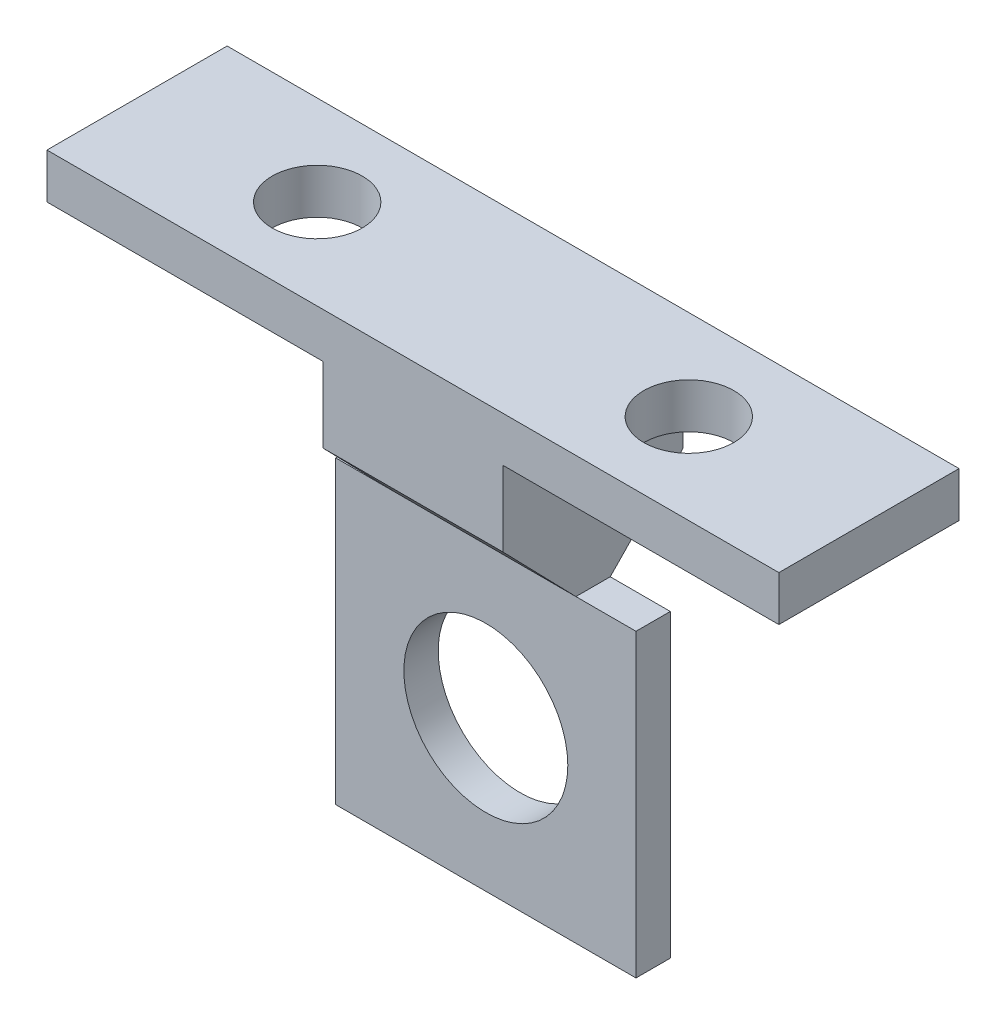
ISO-10303-21;
HEADER;
FILE_DESCRIPTION(('STEP AP214'),'2;1');
FILE_NAME('part.step','',(''),(''),'','','');
FILE_SCHEMA(('AUTOMOTIVE_DESIGN { 1 0 10303 214 1 1 1 1 }'));
ENDSEC;
DATA;
#1=APPLICATION_CONTEXT('core data for automotive mechanical design processes');
#2=APPLICATION_PROTOCOL_DEFINITION('international standard','automotive_design',2000,#1);
#3=PRODUCT_CONTEXT('',#1,'mechanical');
#4=PRODUCT('Part','Part','',(#3));
#5=PRODUCT_RELATED_PRODUCT_CATEGORY('part','',(#4));
#6=PRODUCT_DEFINITION_FORMATION('','',#4);
#7=PRODUCT_DEFINITION_CONTEXT('part definition',#1,'design');
#8=PRODUCT_DEFINITION('design','',#6,#7);
#9=PRODUCT_DEFINITION_SHAPE('','',#8);
#10=(LENGTH_UNIT() NAMED_UNIT(*) SI_UNIT(.MILLI.,.METRE.));
#11=(NAMED_UNIT(*) PLANE_ANGLE_UNIT() SI_UNIT($,.RADIAN.));
#12=(NAMED_UNIT(*) SI_UNIT($,.STERADIAN.) SOLID_ANGLE_UNIT());
#13=UNCERTAINTY_MEASURE_WITH_UNIT(LENGTH_MEASURE(1.E-05),#10,'distance_accuracy_value','');
#14=(GEOMETRIC_REPRESENTATION_CONTEXT(3) GLOBAL_UNCERTAINTY_ASSIGNED_CONTEXT((#13)) GLOBAL_UNIT_ASSIGNED_CONTEXT((#10,
#11,#12)) REPRESENTATION_CONTEXT('',''));
#15=CARTESIAN_POINT('',(0.,0.,0.));
#16=DIRECTION('',(0.,0.,1.));
#17=DIRECTION('',(1.,0.,0.));
#18=AXIS2_PLACEMENT_3D('',#15,#16,#17);
#19=CARTESIAN_POINT('',(-33.0408964823714,13.4768329024308,2.286));
#20=DIRECTION('',(0.,1.,0.));
#21=DIRECTION('',(0.,0.,1.));
#22=AXIS2_PLACEMENT_3D('',#19,#20,#21);
#23=PLANE('',#22);
#24=CARTESIAN_POINT('',(-26.6665293523715,13.4768329024308,1.143));
#25=DIRECTION('',(0.,1.,0.));
#26=DIRECTION('',(0.,0.,1.));
#27=AXIS2_PLACEMENT_3D('',#24,#25,#26);
#28=CIRCLE('',#27,2.99999999999999);
#29=CARTESIAN_POINT('',(-26.6665293523715,13.4768329024308,4.14299999999999));
#30=VERTEX_POINT('',#29);
#31=EDGE_CURVE('E302',#30,#30,#28,.F.);
#32=ORIENTED_EDGE('',*,*,#31,.F.);
#33=EDGE_LOOP('',(#32));
#34=FACE_BOUND('',#33,.T.);
#35=DIRECTION('',(0.,0.,-1.));
#36=VECTOR('',#35,1.);
#37=CARTESIAN_POINT('',(-33.0408964823714,13.4768329024308,2.286));
#38=LINE('',#37,#36);
#39=CARTESIAN_POINT('',(-33.0408964823714,13.4768329024311,7.143));
#40=VERTEX_POINT('',#39);
#41=CARTESIAN_POINT('',(-33.0408964823714,13.4768329024311,-4.857));
#42=VERTEX_POINT('',#41);
#43=EDGE_CURVE('E60',#40,#42,#38,.T.);
#44=ORIENTED_EDGE('',*,*,#43,.T.);
#45=DIRECTION('',(-1.,0.,0.));
#46=VECTOR('',#45,1.);
#47=CARTESIAN_POINT('',(-2.29721093551843,13.4768329024311,-4.857));
#48=LINE('',#47,#46);
#49=CARTESIAN_POINT('',(-14.6665278123714,13.4768329024311,-4.857));
#50=VERTEX_POINT('',#49);
#51=EDGE_CURVE('E202',#50,#42,#48,.T.);
#52=ORIENTED_EDGE('',*,*,#51,.F.);
#53=DIRECTION('',(0.,0.,-1.));
#54=VECTOR('',#53,1.);
#55=CARTESIAN_POINT('',(-14.6665278123714,13.4768329024308,2.286));
#56=LINE('',#55,#54);
#57=CARTESIAN_POINT('',(-14.6665278123714,13.4768329024311,7.143));
#58=VERTEX_POINT('',#57);
#59=EDGE_CURVE('E229',#58,#50,#56,.T.);
#60=ORIENTED_EDGE('',*,*,#59,.F.);
#61=DIRECTION('',(-1.,0.,0.));
#62=VECTOR('',#61,1.);
#63=CARTESIAN_POINT('',(-2.29721093551843,13.4768329024311,7.143));
#64=LINE('',#63,#62);
#65=EDGE_CURVE('E199',#58,#40,#64,.T.);
#66=ORIENTED_EDGE('',*,*,#65,.T.);
#67=EDGE_LOOP('',(#44,#52,#60,#66));
#68=FACE_BOUND('',#67,.T.);
#69=ADVANCED_FACE('F37',(#34,#68),#23,.F.);
#70=CARTESIAN_POINT('',(-51.4152636123715,13.4768329024308,1.143));
#71=DIRECTION('',(0.,1.,0.));
#72=DIRECTION('',(0.,0.,1.));
#73=AXIS2_PLACEMENT_3D('',#70,#71,#72);
#74=CIRCLE('',#73,3.);
#75=CARTESIAN_POINT('',(-51.4152636123715,13.4768329024308,4.143));
#76=VERTEX_POINT('',#75);
#77=EDGE_CURVE('E307',#76,#76,#74,.F.);
#78=ORIENTED_EDGE('',*,*,#77,.F.);
#79=EDGE_LOOP('',(#78));
#80=FACE_BOUND('',#79,.T.);
#81=DIRECTION('',(0.,0.,-1.));
#82=VECTOR('',#81,1.);
#83=CARTESIAN_POINT('',(-45.0408964823714,13.4768329024308,2.286));
#84=LINE('',#83,#82);
#85=CARTESIAN_POINT('',(-45.0408964823714,13.4768329024311,7.143));
#86=VERTEX_POINT('',#85);
#87=CARTESIAN_POINT('',(-45.0408964823714,13.4768329024311,-4.857));
#88=VERTEX_POINT('',#87);
#89=EDGE_CURVE('E46',#86,#88,#84,.T.);
#90=ORIENTED_EDGE('',*,*,#89,.F.);
#91=CARTESIAN_POINT('',(-63.4152651523715,13.4768329024311,7.143));
#92=VERTEX_POINT('',#91);
#93=EDGE_CURVE('E201',#86,#92,#64,.T.);
#94=ORIENTED_EDGE('',*,*,#93,.T.);
#95=DIRECTION('',(0.,0.,-1.));
#96=VECTOR('',#95,1.);
#97=CARTESIAN_POINT('',(-63.4152651523715,13.4768329024308,2.286));
#98=LINE('',#97,#96);
#99=CARTESIAN_POINT('',(-63.4152651523715,13.4768329024311,-4.857));
#100=VERTEX_POINT('',#99);
#101=EDGE_CURVE('E11',#92,#100,#98,.T.);
#102=ORIENTED_EDGE('',*,*,#101,.T.);
#103=EDGE_CURVE('E193',#88,#100,#48,.T.);
#104=ORIENTED_EDGE('',*,*,#103,.F.);
#105=EDGE_LOOP('',(#90,#94,#102,#104));
#106=FACE_BOUND('',#105,.T.);
#107=ADVANCED_FACE('F338',(#80,#106),#23,.F.);
#108=CARTESIAN_POINT('',(-63.4152651523714,16.4768329024308,2.286));
#109=DIRECTION('',(1.,0.,0.));
#110=DIRECTION('',(0.,1.,0.));
#111=AXIS2_PLACEMENT_3D('',#108,#109,#110);
#112=PLANE('',#111);
#113=DIRECTION('',(0.,0.,-1.));
#114=VECTOR('',#113,1.);
#115=CARTESIAN_POINT('',(-63.4152651523714,16.4768329024308,2.286));
#116=LINE('',#115,#114);
#117=CARTESIAN_POINT('',(-63.4152651523715,16.4768329024311,7.143));
#118=VERTEX_POINT('',#117);
#119=CARTESIAN_POINT('',(-63.4152651523715,16.4768329024311,-4.857));
#120=VERTEX_POINT('',#119);
#121=EDGE_CURVE('E216',#118,#120,#116,.T.);
#122=ORIENTED_EDGE('',*,*,#121,.T.);
#123=DIRECTION('',(0.,-1.,0.));
#124=VECTOR('',#123,1.);
#125=CARTESIAN_POINT('',(-63.4152651523715,16.4768329024311,-4.857));
#126=LINE('',#125,#124);
#127=EDGE_CURVE('E179',#120,#100,#126,.T.);
#128=ORIENTED_EDGE('',*,*,#127,.T.);
#129=ORIENTED_EDGE('',*,*,#101,.F.);
#130=DIRECTION('',(0.,1.,0.));
#131=VECTOR('',#130,1.);
#132=CARTESIAN_POINT('',(-63.4152651523715,16.4768329024311,7.143));
#133=LINE('',#132,#131);
#134=EDGE_CURVE('E190',#92,#118,#133,.T.);
#135=ORIENTED_EDGE('',*,*,#134,.T.);
#136=EDGE_LOOP('',(#122,#128,#129,#135));
#137=FACE_BOUND('',#136,.T.);
#138=ADVANCED_FACE('F39',(#137),#112,.F.);
#139=CARTESIAN_POINT('',(-45.0408964823714,8.47683290243078,2.286));
#140=DIRECTION('',(1.,0.,0.));
#141=DIRECTION('',(0.,0.,-1.));
#142=AXIS2_PLACEMENT_3D('',#139,#140,#141);
#143=PLANE('',#142);
#144=ORIENTED_EDGE('',*,*,#89,.T.);
#145=DIRECTION('',(0.,-1.,0.));
#146=VECTOR('',#145,1.);
#147=CARTESIAN_POINT('',(-45.0408964823714,13.4768329024311,-4.857));
#148=LINE('',#147,#146);
#149=CARTESIAN_POINT('',(-45.0408964823714,8.47683290243107,-4.857));
#150=VERTEX_POINT('',#149);
#151=EDGE_CURVE('E165',#88,#150,#148,.T.);
#152=ORIENTED_EDGE('',*,*,#151,.T.);
#153=DIRECTION('',(0.,-0.71728962347272,0.696775140241358));
#154=VECTOR('',#153,1.);
#155=CARTESIAN_POINT('',(-45.0408964823714,8.47683290243107,-4.857));
#156=LINE('',#155,#154);
#157=CARTESIAN_POINT('',(-45.0408964823714,3.47683290243076,0.));
#158=VERTEX_POINT('',#157);
#159=EDGE_CURVE('E297',#150,#158,#156,.T.);
#160=ORIENTED_EDGE('',*,*,#159,.T.);
#161=DIRECTION('',(0.,0.,-1.));
#162=VECTOR('',#161,1.);
#163=CARTESIAN_POINT('',(-45.0408964823714,3.47683290243078,2.286));
#164=LINE('',#163,#162);
#165=CARTESIAN_POINT('',(-45.0408964823714,3.47683290243078,2.286));
#166=VERTEX_POINT('',#165);
#167=EDGE_CURVE('E246',#166,#158,#164,.T.);
#168=ORIENTED_EDGE('',*,*,#167,.F.);
#169=DIRECTION('',(0.,0.71728962347272,0.696775140241358));
#170=VECTOR('',#169,1.);
#171=CARTESIAN_POINT('',(-45.0408964823714,3.47683290243076,2.286));
#172=LINE('',#171,#170);
#173=CARTESIAN_POINT('',(-45.0408964823714,8.47683290243107,7.143));
#174=VERTEX_POINT('',#173);
#175=EDGE_CURVE('E173',#166,#174,#172,.T.);
#176=ORIENTED_EDGE('',*,*,#175,.T.);
#177=DIRECTION('',(0.,1.,0.));
#178=VECTOR('',#177,1.);
#179=CARTESIAN_POINT('',(-45.0408964823714,8.47683290243107,7.143));
#180=LINE('',#179,#178);
#181=EDGE_CURVE('E147',#174,#86,#180,.T.);
#182=ORIENTED_EDGE('',*,*,#181,.T.);
#183=EDGE_LOOP('',(#144,#152,#160,#168,#176,#182));
#184=FACE_BOUND('',#183,.T.);
#185=ADVANCED_FACE('F296',(#184),#143,.F.);
#186=CARTESIAN_POINT('',(-45.0408964823714,3.47683290243078,2.286));
#187=DIRECTION('',(0.,-1.,0.));
#188=DIRECTION('',(1.,0.,0.));
#189=AXIS2_PLACEMENT_3D('',#186,#187,#188);
#190=PLANE('',#189);
#191=DIRECTION('',(-1.,0.,0.));
#192=VECTOR('',#191,1.);
#193=CARTESIAN_POINT('',(-45.0408964823714,3.47683290243078,0.));
#194=LINE('',#193,#192);
#195=CARTESIAN_POINT('',(-49.0408964823714,3.47683290243077,0.));
#196=VERTEX_POINT('',#195);
#197=EDGE_CURVE('E187',#158,#196,#194,.T.);
#198=ORIENTED_EDGE('',*,*,#197,.T.);
#199=DIRECTION('',(0.,0.,-1.));
#200=VECTOR('',#199,1.);
#201=CARTESIAN_POINT('',(-49.0408964823714,3.47683290243077,2.286));
#202=LINE('',#201,#200);
#203=CARTESIAN_POINT('',(-49.0408964823714,3.47683290243077,2.286));
#204=VERTEX_POINT('',#203);
#205=EDGE_CURVE('E243',#204,#196,#202,.T.);
#206=ORIENTED_EDGE('',*,*,#205,.F.);
#207=DIRECTION('',(-1.,0.,0.));
#208=VECTOR('',#207,1.);
#209=CARTESIAN_POINT('',(-45.0408964823714,3.47683290243078,2.286));
#210=LINE('',#209,#208);
#211=EDGE_CURVE('E205',#166,#204,#210,.T.);
#212=ORIENTED_EDGE('',*,*,#211,.F.);
#213=ORIENTED_EDGE('',*,*,#167,.T.);
#214=EDGE_LOOP('',(#198,#206,#212,#213));
#215=FACE_BOUND('',#214,.T.);
#216=ADVANCED_FACE('F253',(#215),#190,.F.);
#217=CARTESIAN_POINT('',(-49.0408964823714,3.47683290243077,2.286));
#218=DIRECTION('',(1.,0.,0.));
#219=DIRECTION('',(0.,1.,0.));
#220=AXIS2_PLACEMENT_3D('',#217,#218,#219);
#221=PLANE('',#220);
#222=DIRECTION('',(0.,-1.,0.));
#223=VECTOR('',#222,1.);
#224=CARTESIAN_POINT('',(-49.0408964823714,3.47683290243077,0.));
#225=LINE('',#224,#223);
#226=CARTESIAN_POINT('',(-49.0408964823714,-16.5231670975692,0.));
#227=VERTEX_POINT('',#226);
#228=EDGE_CURVE('E218',#196,#227,#225,.T.);
#229=ORIENTED_EDGE('',*,*,#228,.T.);
#230=DIRECTION('',(0.,0.,-1.));
#231=VECTOR('',#230,1.);
#232=CARTESIAN_POINT('',(-49.0408964823714,-16.5231670975692,2.286));
#233=LINE('',#232,#231);
#234=CARTESIAN_POINT('',(-49.0408964823714,-16.5231670975692,2.286));
#235=VERTEX_POINT('',#234);
#236=EDGE_CURVE('E240',#235,#227,#233,.T.);
#237=ORIENTED_EDGE('',*,*,#236,.F.);
#238=DIRECTION('',(0.,-1.,0.));
#239=VECTOR('',#238,1.);
#240=CARTESIAN_POINT('',(-49.0408964823714,3.47683290243077,2.286));
#241=LINE('',#240,#239);
#242=EDGE_CURVE('E207',#204,#235,#241,.T.);
#243=ORIENTED_EDGE('',*,*,#242,.F.);
#244=ORIENTED_EDGE('',*,*,#205,.T.);
#245=EDGE_LOOP('',(#229,#237,#243,#244));
#246=FACE_BOUND('',#245,.T.);
#247=ADVANCED_FACE('F264',(#246),#221,.F.);
#248=CARTESIAN_POINT('',(-49.0408964823714,-16.5231670975692,2.286));
#249=DIRECTION('',(0.,1.,0.));
#250=DIRECTION('',(-1.,0.,0.));
#251=AXIS2_PLACEMENT_3D('',#248,#249,#250);
#252=PLANE('',#251);
#253=DIRECTION('',(1.,0.,0.));
#254=VECTOR('',#253,1.);
#255=CARTESIAN_POINT('',(-49.0408964823714,-16.5231670975692,0.));
#256=LINE('',#255,#254);
#257=CARTESIAN_POINT('',(-29.0408964823714,-16.5231670975692,0.));
#258=VERTEX_POINT('',#257);
#259=EDGE_CURVE('E220',#227,#258,#256,.T.);
#260=ORIENTED_EDGE('',*,*,#259,.T.);
#261=DIRECTION('',(0.,0.,-1.));
#262=VECTOR('',#261,1.);
#263=CARTESIAN_POINT('',(-29.0408964823714,-16.5231670975692,2.286));
#264=LINE('',#263,#262);
#265=CARTESIAN_POINT('',(-29.0408964823714,-16.5231670975692,2.286));
#266=VERTEX_POINT('',#265);
#267=EDGE_CURVE('E237',#266,#258,#264,.T.);
#268=ORIENTED_EDGE('',*,*,#267,.F.);
#269=DIRECTION('',(1.,0.,0.));
#270=VECTOR('',#269,1.);
#271=CARTESIAN_POINT('',(-49.0408964823714,-16.5231670975692,2.286));
#272=LINE('',#271,#270);
#273=EDGE_CURVE('E210',#235,#266,#272,.T.);
#274=ORIENTED_EDGE('',*,*,#273,.F.);
#275=ORIENTED_EDGE('',*,*,#236,.T.);
#276=EDGE_LOOP('',(#260,#268,#274,#275));
#277=FACE_BOUND('',#276,.T.);
#278=ADVANCED_FACE('F268',(#277),#252,.F.);
#279=CARTESIAN_POINT('',(-29.0408964823714,3.47683290243078,2.286));
#280=DIRECTION('',(-1.,0.,0.));
#281=DIRECTION('',(0.,0.,1.));
#282=AXIS2_PLACEMENT_3D('',#279,#280,#281);
#283=PLANE('',#282);
#284=DIRECTION('',(0.,1.,0.));
#285=VECTOR('',#284,1.);
#286=CARTESIAN_POINT('',(-29.0408964823714,3.47683290243078,0.));
#287=LINE('',#286,#285);
#288=CARTESIAN_POINT('',(-29.0408964823714,3.47683290243078,0.));
#289=VERTEX_POINT('',#288);
#290=EDGE_CURVE('E222',#258,#289,#287,.T.);
#291=ORIENTED_EDGE('',*,*,#290,.T.);
#292=DIRECTION('',(0.,0.,-1.));
#293=VECTOR('',#292,1.);
#294=CARTESIAN_POINT('',(-29.0408964823714,3.47683290243078,2.286));
#295=LINE('',#294,#293);
#296=CARTESIAN_POINT('',(-29.0408964823714,3.47683290243078,2.286));
#297=VERTEX_POINT('',#296);
#298=EDGE_CURVE('E234',#297,#289,#295,.T.);
#299=ORIENTED_EDGE('',*,*,#298,.F.);
#300=DIRECTION('',(0.,1.,0.));
#301=VECTOR('',#300,1.);
#302=CARTESIAN_POINT('',(-29.0408964823714,3.47683290243078,2.286));
#303=LINE('',#302,#301);
#304=EDGE_CURVE('E212',#266,#297,#303,.T.);
#305=ORIENTED_EDGE('',*,*,#304,.F.);
#306=ORIENTED_EDGE('',*,*,#267,.T.);
#307=EDGE_LOOP('',(#291,#299,#305,#306));
#308=FACE_BOUND('',#307,.T.);
#309=ADVANCED_FACE('F352',(#308),#283,.F.);
#310=CARTESIAN_POINT('',(-29.0408964823714,3.47683290243078,2.286));
#311=DIRECTION('',(0.,-1.,0.));
#312=DIRECTION('',(1.,0.,0.));
#313=AXIS2_PLACEMENT_3D('',#310,#311,#312);
#314=PLANE('',#313);
#315=DIRECTION('',(-1.,0.,0.));
#316=VECTOR('',#315,1.);
#317=CARTESIAN_POINT('',(-29.0408964823714,3.47683290243078,0.));
#318=LINE('',#317,#316);
#319=CARTESIAN_POINT('',(-33.0408964823714,3.47683290243076,0.));
#320=VERTEX_POINT('',#319);
#321=EDGE_CURVE('E208',#289,#320,#318,.T.);
#322=ORIENTED_EDGE('',*,*,#321,.T.);
#323=DIRECTION('',(0.,0.,-1.));
#324=VECTOR('',#323,1.);
#325=CARTESIAN_POINT('',(-33.0408964823714,3.47683290243078,2.286));
#326=LINE('',#325,#324);
#327=CARTESIAN_POINT('',(-33.0408964823714,3.47683290243078,2.286));
#328=VERTEX_POINT('',#327);
#329=EDGE_CURVE('E232',#328,#320,#326,.T.);
#330=ORIENTED_EDGE('',*,*,#329,.F.);
#331=DIRECTION('',(-1.,0.,0.));
#332=VECTOR('',#331,1.);
#333=CARTESIAN_POINT('',(-29.0408964823714,3.47683290243078,2.286));
#334=LINE('',#333,#332);
#335=EDGE_CURVE('E214',#297,#328,#334,.T.);
#336=ORIENTED_EDGE('',*,*,#335,.F.);
#337=ORIENTED_EDGE('',*,*,#298,.T.);
#338=EDGE_LOOP('',(#322,#330,#336,#337));
#339=FACE_BOUND('',#338,.T.);
#340=ADVANCED_FACE('F277',(#339),#314,.F.);
#341=CARTESIAN_POINT('',(-33.0408964823714,13.4768329024308,2.286));
#342=DIRECTION('',(-1.,0.,0.));
#343=DIRECTION('',(0.,0.,1.));
#344=AXIS2_PLACEMENT_3D('',#341,#342,#343);
#345=PLANE('',#344);
#346=ORIENTED_EDGE('',*,*,#329,.T.);
#347=DIRECTION('',(0.,0.71728962347272,-0.696775140241358));
#348=VECTOR('',#347,1.);
#349=CARTESIAN_POINT('',(-33.0408964823714,8.47683290243107,-4.857));
#350=LINE('',#349,#348);
#351=CARTESIAN_POINT('',(-33.0408964823714,8.47683290243107,-4.857));
#352=VERTEX_POINT('',#351);
#353=EDGE_CURVE('E158',#320,#352,#350,.T.);
#354=ORIENTED_EDGE('',*,*,#353,.T.);
#355=DIRECTION('',(0.,1.,0.));
#356=VECTOR('',#355,1.);
#357=CARTESIAN_POINT('',(-33.0408964823714,13.4768329024311,-4.857));
#358=LINE('',#357,#356);
#359=EDGE_CURVE('E151',#352,#42,#358,.T.);
#360=ORIENTED_EDGE('',*,*,#359,.T.);
#361=ORIENTED_EDGE('',*,*,#43,.F.);
#362=DIRECTION('',(0.,-1.,0.));
#363=VECTOR('',#362,1.);
#364=CARTESIAN_POINT('',(-33.0408964823714,8.47683290243107,7.143));
#365=LINE('',#364,#363);
#366=CARTESIAN_POINT('',(-33.0408964823714,8.47683290243107,7.143));
#367=VERTEX_POINT('',#366);
#368=EDGE_CURVE('E145',#40,#367,#365,.T.);
#369=ORIENTED_EDGE('',*,*,#368,.T.);
#370=DIRECTION('',(0.,-0.71728962347272,-0.696775140241358));
#371=VECTOR('',#370,1.);
#372=CARTESIAN_POINT('',(-33.0408964823714,3.47683290243076,2.286));
#373=LINE('',#372,#371);
#374=EDGE_CURVE('E155',#367,#328,#373,.T.);
#375=ORIENTED_EDGE('',*,*,#374,.T.);
#376=EDGE_LOOP('',(#346,#354,#360,#361,#369,#375));
#377=FACE_BOUND('',#376,.T.);
#378=ADVANCED_FACE('F160',(#377),#345,.F.);
#379=CARTESIAN_POINT('',(-14.6665278123714,16.4768329024308,2.286));
#380=DIRECTION('',(-1.,0.,0.));
#381=DIRECTION('',(0.,-1.,0.));
#382=AXIS2_PLACEMENT_3D('',#379,#380,#381);
#383=PLANE('',#382);
#384=ORIENTED_EDGE('',*,*,#59,.T.);
#385=DIRECTION('',(0.,1.,0.));
#386=VECTOR('',#385,1.);
#387=CARTESIAN_POINT('',(-14.6665278123714,16.476832902431,-4.857));
#388=LINE('',#387,#386);
#389=CARTESIAN_POINT('',(-14.6665278123714,16.4768329024311,-4.857));
#390=VERTEX_POINT('',#389);
#391=EDGE_CURVE('E183',#50,#390,#388,.T.);
#392=ORIENTED_EDGE('',*,*,#391,.T.);
#393=DIRECTION('',(0.,0.,-1.));
#394=VECTOR('',#393,1.);
#395=CARTESIAN_POINT('',(-14.6665278123714,16.4768329024308,2.286));
#396=LINE('',#395,#394);
#397=CARTESIAN_POINT('',(-14.6665278123714,16.4768329024311,7.143));
#398=VERTEX_POINT('',#397);
#399=EDGE_CURVE('E227',#398,#390,#396,.T.);
#400=ORIENTED_EDGE('',*,*,#399,.F.);
#401=DIRECTION('',(0.,-1.,0.));
#402=VECTOR('',#401,1.);
#403=CARTESIAN_POINT('',(-14.6665278123714,16.476832902431,7.143));
#404=LINE('',#403,#402);
#405=EDGE_CURVE('E180',#398,#58,#404,.T.);
#406=ORIENTED_EDGE('',*,*,#405,.T.);
#407=EDGE_LOOP('',(#384,#392,#400,#406));
#408=FACE_BOUND('',#407,.T.);
#409=ADVANCED_FACE('F319',(#408),#383,.F.);
#410=CARTESIAN_POINT('',(-14.6665278123714,16.4768329024308,2.286));
#411=DIRECTION('',(0.,-1.,0.));
#412=DIRECTION('',(0.,0.,-1.));
#413=AXIS2_PLACEMENT_3D('',#410,#411,#412);
#414=PLANE('',#413);
#415=CARTESIAN_POINT('',(-26.6665293523715,16.4768329024308,1.143));
#416=DIRECTION('',(0.,1.,0.));
#417=DIRECTION('',(0.,0.,1.));
#418=AXIS2_PLACEMENT_3D('',#415,#416,#417);
#419=CIRCLE('',#418,2.99999999999999);
#420=CARTESIAN_POINT('',(-26.6665293523715,16.4768329024308,4.14299999999999));
#421=VERTEX_POINT('',#420);
#422=EDGE_CURVE('E306',#421,#421,#419,.T.);
#423=ORIENTED_EDGE('',*,*,#422,.F.);
#424=EDGE_LOOP('',(#423));
#425=FACE_BOUND('',#424,.T.);
#426=CARTESIAN_POINT('',(-51.4152636123715,16.4768329024308,1.143));
#427=DIRECTION('',(0.,1.,0.));
#428=DIRECTION('',(0.,0.,1.));
#429=AXIS2_PLACEMENT_3D('',#426,#427,#428);
#430=CIRCLE('',#429,3.);
#431=CARTESIAN_POINT('',(-51.4152636123715,16.4768329024308,4.143));
#432=VERTEX_POINT('',#431);
#433=EDGE_CURVE('E303',#432,#432,#430,.T.);
#434=ORIENTED_EDGE('',*,*,#433,.F.);
#435=EDGE_LOOP('',(#434));
#436=FACE_BOUND('',#435,.T.);
#437=ORIENTED_EDGE('',*,*,#399,.T.);
#438=DIRECTION('',(-1.,0.,0.));
#439=VECTOR('',#438,1.);
#440=CARTESIAN_POINT('',(-2.29721093551843,16.4768329024311,-4.857));
#441=LINE('',#440,#439);
#442=EDGE_CURVE('E184',#390,#120,#441,.T.);
#443=ORIENTED_EDGE('',*,*,#442,.T.);
#444=ORIENTED_EDGE('',*,*,#121,.F.);
#445=DIRECTION('',(-1.,0.,0.));
#446=VECTOR('',#445,1.);
#447=CARTESIAN_POINT('',(-2.29721093551843,16.4768329024311,7.143));
#448=LINE('',#447,#446);
#449=EDGE_CURVE('E196',#398,#118,#448,.T.);
#450=ORIENTED_EDGE('',*,*,#449,.F.);
#451=EDGE_LOOP('',(#437,#443,#444,#450));
#452=FACE_BOUND('',#451,.T.);
#453=ADVANCED_FACE('F291',(#425,#436,#452),#414,.F.);
#454=CARTESIAN_POINT('',(0.,0.,2.286));
#455=DIRECTION('',(0.,0.,1.));
#456=DIRECTION('',(1.,0.,0.));
#457=AXIS2_PLACEMENT_3D('',#454,#455,#456);
#458=PLANE('',#457);
#459=CARTESIAN_POINT('',(-39.0408964823714,-6.52316709756922,2.286));
#460=DIRECTION('',(0.,0.,1.));
#461=DIRECTION('',(1.,0.,0.));
#462=AXIS2_PLACEMENT_3D('',#459,#460,#461);
#463=CIRCLE('',#462,5.46);
#464=CARTESIAN_POINT('',(-33.5808964823714,-6.52316709756922,2.286));
#465=VERTEX_POINT('',#464);
#466=EDGE_CURVE('E163',#465,#465,#463,.T.);
#467=ORIENTED_EDGE('',*,*,#466,.F.);
#468=EDGE_LOOP('',(#467));
#469=FACE_BOUND('',#468,.T.);
#470=DIRECTION('',(1.,0.,0.));
#471=VECTOR('',#470,1.);
#472=CARTESIAN_POINT('',(-60.6613958341849,3.47683290243076,2.286));
#473=LINE('',#472,#471);
#474=EDGE_CURVE('E150',#166,#328,#473,.T.);
#475=ORIENTED_EDGE('',*,*,#474,.F.);
#476=ORIENTED_EDGE('',*,*,#211,.T.);
#477=ORIENTED_EDGE('',*,*,#242,.T.);
#478=ORIENTED_EDGE('',*,*,#273,.T.);
#479=ORIENTED_EDGE('',*,*,#304,.T.);
#480=ORIENTED_EDGE('',*,*,#335,.T.);
#481=EDGE_LOOP('',(#475,#476,#477,#478,#479,#480));
#482=FACE_BOUND('',#481,.T.);
#483=ADVANCED_FACE('F272',(#469,#482),#458,.T.);
#484=CARTESIAN_POINT('',(0.,0.,0.));
#485=DIRECTION('',(0.,0.,1.));
#486=DIRECTION('',(1.,0.,0.));
#487=AXIS2_PLACEMENT_3D('',#484,#485,#486);
#488=PLANE('',#487);
#489=CARTESIAN_POINT('',(-39.0408964823714,-6.52316709756922,0.));
#490=DIRECTION('',(0.,0.,1.));
#491=DIRECTION('',(1.,0.,0.));
#492=AXIS2_PLACEMENT_3D('',#489,#490,#491);
#493=CIRCLE('',#492,5.46);
#494=CARTESIAN_POINT('',(-33.5808964823714,-6.52316709756922,0.));
#495=VERTEX_POINT('',#494);
#496=EDGE_CURVE('E41',#495,#495,#493,.T.);
#497=ORIENTED_EDGE('',*,*,#496,.T.);
#498=EDGE_LOOP('',(#497));
#499=FACE_BOUND('',#498,.T.);
#500=ORIENTED_EDGE('',*,*,#197,.F.);
#501=DIRECTION('',(1.,0.,0.));
#502=VECTOR('',#501,1.);
#503=CARTESIAN_POINT('',(-60.6613958341849,3.47683290243076,0.));
#504=LINE('',#503,#502);
#505=EDGE_CURVE('E174',#158,#320,#504,.T.);
#506=ORIENTED_EDGE('',*,*,#505,.T.);
#507=ORIENTED_EDGE('',*,*,#321,.F.);
#508=ORIENTED_EDGE('',*,*,#290,.F.);
#509=ORIENTED_EDGE('',*,*,#259,.F.);
#510=ORIENTED_EDGE('',*,*,#228,.F.);
#511=EDGE_LOOP('',(#500,#506,#507,#508,#509,#510));
#512=FACE_BOUND('',#511,.T.);
#513=ADVANCED_FACE('F257',(#499,#512),#488,.F.);
#514=CARTESIAN_POINT('',(-2.29721093551843,16.4768329024311,-4.857));
#515=DIRECTION('',(0.,0.,-1.));
#516=DIRECTION('',(-1.,0.,0.));
#517=AXIS2_PLACEMENT_3D('',#514,#515,#516);
#518=PLANE('',#517);
#519=ORIENTED_EDGE('',*,*,#391,.F.);
#520=ORIENTED_EDGE('',*,*,#51,.T.);
#521=ORIENTED_EDGE('',*,*,#359,.F.);
#522=DIRECTION('',(1.,0.,0.));
#523=VECTOR('',#522,1.);
#524=CARTESIAN_POINT('',(-60.6613958341849,8.47683290243107,-4.857));
#525=LINE('',#524,#523);
#526=EDGE_CURVE('E171',#150,#352,#525,.T.);
#527=ORIENTED_EDGE('',*,*,#526,.F.);
#528=ORIENTED_EDGE('',*,*,#151,.F.);
#529=ORIENTED_EDGE('',*,*,#103,.T.);
#530=ORIENTED_EDGE('',*,*,#127,.F.);
#531=ORIENTED_EDGE('',*,*,#442,.F.);
#532=EDGE_LOOP('',(#519,#520,#521,#527,#528,#529,#530,#531));
#533=FACE_BOUND('',#532,.T.);
#534=ADVANCED_FACE('F283',(#533),#518,.T.);
#535=CARTESIAN_POINT('',(-2.29721093551843,16.4768329024311,7.143));
#536=DIRECTION('',(0.,0.,1.));
#537=DIRECTION('',(1.,0.,0.));
#538=AXIS2_PLACEMENT_3D('',#535,#536,#537);
#539=PLANE('',#538);
#540=ORIENTED_EDGE('',*,*,#405,.F.);
#541=ORIENTED_EDGE('',*,*,#449,.T.);
#542=ORIENTED_EDGE('',*,*,#134,.F.);
#543=ORIENTED_EDGE('',*,*,#93,.F.);
#544=ORIENTED_EDGE('',*,*,#181,.F.);
#545=DIRECTION('',(1.,0.,0.));
#546=VECTOR('',#545,1.);
#547=CARTESIAN_POINT('',(-60.6613958341849,8.47683290243107,7.143));
#548=LINE('',#547,#546);
#549=EDGE_CURVE('E140',#174,#367,#548,.T.);
#550=ORIENTED_EDGE('',*,*,#549,.T.);
#551=ORIENTED_EDGE('',*,*,#368,.F.);
#552=ORIENTED_EDGE('',*,*,#65,.F.);
#553=EDGE_LOOP('',(#540,#541,#542,#543,#544,#550,#551,#552));
#554=FACE_BOUND('',#553,.T.);
#555=ADVANCED_FACE('F143',(#554),#539,.T.);
#556=CARTESIAN_POINT('',(-60.6613958341849,3.47683290243076,2.286));
#557=DIRECTION('',(0.,-0.696775140241358,0.71728962347272));
#558=DIRECTION('',(0.,-0.71728962347272,-0.696775140241358));
#559=AXIS2_PLACEMENT_3D('',#556,#557,#558);
#560=PLANE('',#559);
#561=ORIENTED_EDGE('',*,*,#175,.F.);
#562=ORIENTED_EDGE('',*,*,#474,.T.);
#563=ORIENTED_EDGE('',*,*,#374,.F.);
#564=ORIENTED_EDGE('',*,*,#549,.F.);
#565=EDGE_LOOP('',(#561,#562,#563,#564));
#566=FACE_BOUND('',#565,.T.);
#567=ADVANCED_FACE('F156',(#566),#560,.T.);
#568=CARTESIAN_POINT('',(-60.6613958341849,8.47683290243107,-4.857));
#569=DIRECTION('',(0.,-0.696775140241358,-0.71728962347272));
#570=DIRECTION('',(0.,0.71728962347272,-0.696775140241358));
#571=AXIS2_PLACEMENT_3D('',#568,#569,#570);
#572=PLANE('',#571);
#573=ORIENTED_EDGE('',*,*,#159,.F.);
#574=ORIENTED_EDGE('',*,*,#526,.T.);
#575=ORIENTED_EDGE('',*,*,#353,.F.);
#576=ORIENTED_EDGE('',*,*,#505,.F.);
#577=EDGE_LOOP('',(#573,#574,#575,#576));
#578=FACE_BOUND('',#577,.T.);
#579=ADVANCED_FACE('F334',(#578),#572,.T.);
#580=CARTESIAN_POINT('',(-39.0408964823714,-6.52316709756922,-4.857));
#581=DIRECTION('',(0.,0.,1.));
#582=DIRECTION('',(1.,0.,0.));
#583=AXIS2_PLACEMENT_3D('',#580,#581,#582);
#584=CYLINDRICAL_SURFACE('',#583,5.46);
#585=ORIENTED_EDGE('',*,*,#466,.T.);
#586=EDGE_LOOP('',(#585));
#587=FACE_BOUND('',#586,.T.);
#588=ORIENTED_EDGE('',*,*,#496,.F.);
#589=EDGE_LOOP('',(#588));
#590=FACE_BOUND('',#589,.T.);
#591=ADVANCED_FACE('F325',(#587,#590),#584,.F.);
#592=CARTESIAN_POINT('',(-51.4152636123715,4.9915515281922,1.143));
#593=DIRECTION('',(0.,1.,0.));
#594=DIRECTION('',(0.,0.,1.));
#595=AXIS2_PLACEMENT_3D('',#592,#593,#594);
#596=CYLINDRICAL_SURFACE('',#595,3.);
#597=ORIENTED_EDGE('',*,*,#77,.T.);
#598=EDGE_LOOP('',(#597));
#599=FACE_BOUND('',#598,.T.);
#600=ORIENTED_EDGE('',*,*,#433,.T.);
#601=EDGE_LOOP('',(#600));
#602=FACE_BOUND('',#601,.T.);
#603=ADVANCED_FACE('F323',(#599,#602),#596,.F.);
#604=CARTESIAN_POINT('',(-26.6665293523715,4.9915515281922,1.143));
#605=DIRECTION('',(0.,1.,0.));
#606=DIRECTION('',(0.,0.,1.));
#607=AXIS2_PLACEMENT_3D('',#604,#605,#606);
#608=CYLINDRICAL_SURFACE('',#607,2.99999999999999);
#609=ORIENTED_EDGE('',*,*,#31,.T.);
#610=EDGE_LOOP('',(#609));
#611=FACE_BOUND('',#610,.T.);
#612=ORIENTED_EDGE('',*,*,#422,.T.);
#613=EDGE_LOOP('',(#612));
#614=FACE_BOUND('',#613,.T.);
#615=ADVANCED_FACE('F315',(#611,#614),#608,.F.);
#616=CLOSED_SHELL('',(#69,#107,#138,#185,#216,#247,#278,#309,#340,#378,#409,#453,#483,#513,#534,
#555,#567,#579,#591,#603,#615));
#617=MANIFOLD_SOLID_BREP('B2',#616);
#618=ADVANCED_BREP_SHAPE_REPRESENTATION('',(#18,#617),#14);
#619=SHAPE_DEFINITION_REPRESENTATION(#9,#618);
ENDSEC;
END-ISO-10303-21;
